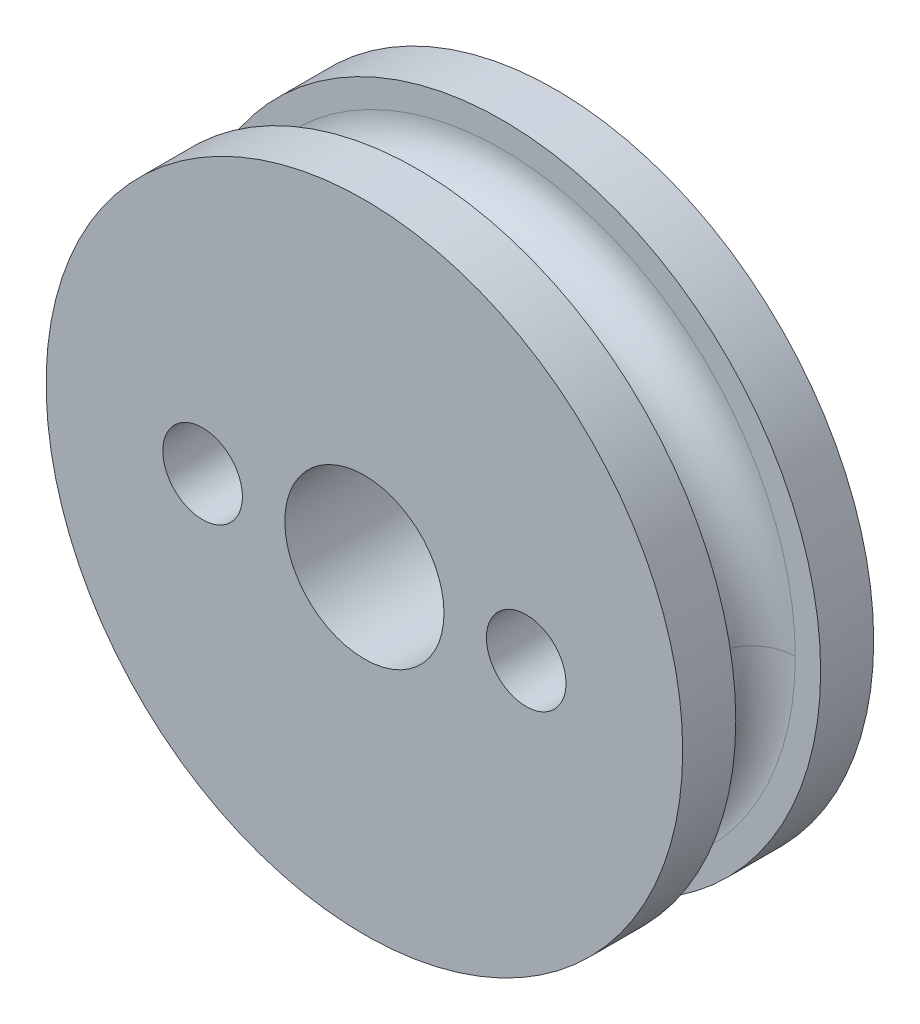
ISO-10303-21;
HEADER;
FILE_DESCRIPTION(('STEP AP214'),'2;1');
FILE_NAME('part.step','',(''),(''),'','','');
FILE_SCHEMA(('AUTOMOTIVE_DESIGN { 1 0 10303 214 1 1 1 1 }'));
ENDSEC;
DATA;
#1=APPLICATION_CONTEXT('core data for automotive mechanical design processes');
#2=APPLICATION_PROTOCOL_DEFINITION('international standard','automotive_design',2000,#1);
#3=PRODUCT_CONTEXT('',#1,'mechanical');
#4=PRODUCT('Part','Part','',(#3));
#5=PRODUCT_RELATED_PRODUCT_CATEGORY('part','',(#4));
#6=PRODUCT_DEFINITION_FORMATION('','',#4);
#7=PRODUCT_DEFINITION_CONTEXT('part definition',#1,'design');
#8=PRODUCT_DEFINITION('design','',#6,#7);
#9=PRODUCT_DEFINITION_SHAPE('','',#8);
#10=(LENGTH_UNIT() NAMED_UNIT(*) SI_UNIT(.MILLI.,.METRE.));
#11=(NAMED_UNIT(*) PLANE_ANGLE_UNIT() SI_UNIT($,.RADIAN.));
#12=(NAMED_UNIT(*) SI_UNIT($,.STERADIAN.) SOLID_ANGLE_UNIT());
#13=UNCERTAINTY_MEASURE_WITH_UNIT(LENGTH_MEASURE(1.E-05),#10,'distance_accuracy_value','');
#14=(GEOMETRIC_REPRESENTATION_CONTEXT(3) GLOBAL_UNCERTAINTY_ASSIGNED_CONTEXT((#13)) GLOBAL_UNIT_ASSIGNED_CONTEXT((#10,
#11,#12)) REPRESENTATION_CONTEXT('',''));
#15=CARTESIAN_POINT('',(0.,0.,0.));
#16=DIRECTION('',(0.,0.,1.));
#17=DIRECTION('',(1.,0.,0.));
#18=AXIS2_PLACEMENT_3D('',#15,#16,#17);
#19=CARTESIAN_POINT('',(-6.1,0.,7.2));
#20=DIRECTION('',(0.,0.,-1.));
#21=DIRECTION('',(-1.,0.,0.));
#22=AXIS2_PLACEMENT_3D('',#19,#20,#21);
#23=CYLINDRICAL_SURFACE('',#22,1.5);
#24=CARTESIAN_POINT('',(-6.1,0.,7.2));
#25=DIRECTION('',(0.,0.,-1.));
#26=DIRECTION('',(-1.,0.,0.));
#27=AXIS2_PLACEMENT_3D('',#24,#25,#26);
#28=CIRCLE('',#27,1.5);
#29=CARTESIAN_POINT('',(-7.6,0.,7.2));
#30=VERTEX_POINT('',#29);
#31=EDGE_CURVE('E110',#30,#30,#28,.T.);
#32=ORIENTED_EDGE('',*,*,#31,.F.);
#33=EDGE_LOOP('',(#32));
#34=FACE_BOUND('',#33,.T.);
#35=CARTESIAN_POINT('',(-6.1,0.,4.));
#36=DIRECTION('',(0.,0.,-1.));
#37=DIRECTION('',(-1.,0.,0.));
#38=AXIS2_PLACEMENT_3D('',#35,#36,#37);
#39=CIRCLE('',#38,1.5);
#40=CARTESIAN_POINT('',(-7.6,0.,4.));
#41=VERTEX_POINT('',#40);
#42=EDGE_CURVE('E37',#41,#41,#39,.F.);
#43=ORIENTED_EDGE('',*,*,#42,.F.);
#44=EDGE_LOOP('',(#43));
#45=FACE_BOUND('',#44,.T.);
#46=ADVANCED_FACE('F33',(#34,#45),#23,.F.);
#47=CARTESIAN_POINT('',(6.1,0.,7.2));
#48=DIRECTION('',(0.,0.,-1.));
#49=DIRECTION('',(-1.,0.,0.));
#50=AXIS2_PLACEMENT_3D('',#47,#48,#49);
#51=CYLINDRICAL_SURFACE('',#50,1.5);
#52=CARTESIAN_POINT('',(6.1,0.,7.2));
#53=DIRECTION('',(0.,0.,-1.));
#54=DIRECTION('',(-1.,0.,0.));
#55=AXIS2_PLACEMENT_3D('',#52,#53,#54);
#56=CIRCLE('',#55,1.5);
#57=CARTESIAN_POINT('',(4.6,0.,7.2));
#58=VERTEX_POINT('',#57);
#59=EDGE_CURVE('E111',#58,#58,#56,.T.);
#60=ORIENTED_EDGE('',*,*,#59,.F.);
#61=EDGE_LOOP('',(#60));
#62=FACE_BOUND('',#61,.T.);
#63=CARTESIAN_POINT('',(6.1,0.,4.));
#64=DIRECTION('',(0.,0.,-1.));
#65=DIRECTION('',(-1.,0.,0.));
#66=AXIS2_PLACEMENT_3D('',#63,#64,#65);
#67=CIRCLE('',#66,1.5);
#68=CARTESIAN_POINT('',(4.6,0.,4.));
#69=VERTEX_POINT('',#68);
#70=EDGE_CURVE('E87',#69,#69,#67,.F.);
#71=ORIENTED_EDGE('',*,*,#70,.F.);
#72=EDGE_LOOP('',(#71));
#73=FACE_BOUND('',#72,.T.);
#74=ADVANCED_FACE('F130',(#62,#73),#51,.F.);
#75=CARTESIAN_POINT('',(0.,0.,2.));
#76=DIRECTION('',(0.,0.,-1.));
#77=DIRECTION('',(-1.,0.,0.));
#78=AXIS2_PLACEMENT_3D('',#75,#76,#77);
#79=CYLINDRICAL_SURFACE('',#78,12.);
#80=CARTESIAN_POINT('',(0.,0.,2.));
#81=DIRECTION('',(0.,0.,1.));
#82=DIRECTION('',(1.,0.,0.));
#83=AXIS2_PLACEMENT_3D('',#80,#81,#82);
#84=CIRCLE('',#83,12.);
#85=CARTESIAN_POINT('',(12.,0.,2.));
#86=VERTEX_POINT('',#85);
#87=EDGE_CURVE('E11',#86,#86,#84,.T.);
#88=ORIENTED_EDGE('',*,*,#87,.F.);
#89=EDGE_LOOP('',(#88));
#90=FACE_BOUND('',#89,.T.);
#91=CARTESIAN_POINT('',(0.,0.,0.));
#92=DIRECTION('',(0.,0.,1.));
#93=DIRECTION('',(1.,0.,0.));
#94=AXIS2_PLACEMENT_3D('',#91,#92,#93);
#95=CIRCLE('',#94,12.);
#96=CARTESIAN_POINT('',(12.,0.,0.));
#97=VERTEX_POINT('',#96);
#98=EDGE_CURVE('E42',#97,#97,#95,.T.);
#99=ORIENTED_EDGE('',*,*,#98,.T.);
#100=EDGE_LOOP('',(#99));
#101=FACE_BOUND('',#100,.T.);
#102=ADVANCED_FACE('F35',(#90,#101),#79,.T.);
#103=CARTESIAN_POINT('',(0.,0.,2.));
#104=DIRECTION('',(0.,0.,1.));
#105=DIRECTION('',(1.,0.,0.));
#106=AXIS2_PLACEMENT_3D('',#103,#104,#105);
#107=PLANE('',#106);
#108=CARTESIAN_POINT('',(0.,0.,2.));
#109=DIRECTION('',(0.,0.,1.));
#110=DIRECTION('',(1.,0.,0.));
#111=AXIS2_PLACEMENT_3D('',#108,#109,#110);
#112=CIRCLE('',#111,11.0428737605284);
#113=CARTESIAN_POINT('',(-11.0428737605284,0.,2.));
#114=VERTEX_POINT('',#113);
#115=CARTESIAN_POINT('',(11.0428737605284,0.,2.));
#116=VERTEX_POINT('',#115);
#117=EDGE_CURVE('E70',#114,#116,#112,.T.);
#118=ORIENTED_EDGE('',*,*,#117,.F.);
#119=CARTESIAN_POINT('',(0.,0.,2.));
#120=DIRECTION('',(0.,0.,1.));
#121=DIRECTION('',(1.,0.,0.));
#122=AXIS2_PLACEMENT_3D('',#119,#120,#121);
#123=CIRCLE('',#122,11.0428737605284);
#124=EDGE_CURVE('E72',#116,#114,#123,.T.);
#125=ORIENTED_EDGE('',*,*,#124,.F.);
#126=EDGE_LOOP('',(#118,#125));
#127=FACE_BOUND('',#126,.T.);
#128=ORIENTED_EDGE('',*,*,#87,.T.);
#129=EDGE_LOOP('',(#128));
#130=FACE_BOUND('',#129,.T.);
#131=ADVANCED_FACE('F125',(#127,#130),#107,.T.);
#132=CARTESIAN_POINT('',(0.,0.,0.));
#133=DIRECTION('',(0.,0.,1.));
#134=DIRECTION('',(1.,0.,0.));
#135=AXIS2_PLACEMENT_3D('',#132,#133,#134);
#136=PLANE('',#135);
#137=CARTESIAN_POINT('',(6.1,0.,0.));
#138=DIRECTION('',(0.,0.,-1.));
#139=DIRECTION('',(-1.,0.,0.));
#140=AXIS2_PLACEMENT_3D('',#137,#138,#139);
#141=CIRCLE('',#140,3.);
#142=CARTESIAN_POINT('',(3.1,0.,0.));
#143=VERTEX_POINT('',#142);
#144=EDGE_CURVE('E94',#143,#143,#141,.T.);
#145=ORIENTED_EDGE('',*,*,#144,.F.);
#146=EDGE_LOOP('',(#145));
#147=FACE_BOUND('',#146,.T.);
#148=CARTESIAN_POINT('',(-6.1,0.,0.));
#149=DIRECTION('',(0.,0.,-1.));
#150=DIRECTION('',(-1.,0.,0.));
#151=AXIS2_PLACEMENT_3D('',#148,#149,#150);
#152=CIRCLE('',#151,3.);
#153=CARTESIAN_POINT('',(-9.1,0.,0.));
#154=VERTEX_POINT('',#153);
#155=EDGE_CURVE('E104',#154,#154,#152,.T.);
#156=ORIENTED_EDGE('',*,*,#155,.F.);
#157=EDGE_LOOP('',(#156));
#158=FACE_BOUND('',#157,.T.);
#159=CARTESIAN_POINT('',(0.,0.,0.));
#160=DIRECTION('',(0.,0.,-1.));
#161=DIRECTION('',(-1.,0.,0.));
#162=AXIS2_PLACEMENT_3D('',#159,#160,#161);
#163=CIRCLE('',#162,3.);
#164=CARTESIAN_POINT('',(-3.,0.,0.));
#165=VERTEX_POINT('',#164);
#166=EDGE_CURVE('E86',#165,#165,#163,.T.);
#167=ORIENTED_EDGE('',*,*,#166,.F.);
#168=EDGE_LOOP('',(#167));
#169=FACE_BOUND('',#168,.T.);
#170=ORIENTED_EDGE('',*,*,#98,.F.);
#171=EDGE_LOOP('',(#170));
#172=FACE_BOUND('',#171,.T.);
#173=ADVANCED_FACE('F121',(#147,#158,#169,#172),#136,.F.);
#174=CARTESIAN_POINT('',(0.,0.,7.2));
#175=DIRECTION('',(0.,0.,-1.));
#176=DIRECTION('',(-1.,0.,0.));
#177=AXIS2_PLACEMENT_3D('',#174,#175,#176);
#178=CYLINDRICAL_SURFACE('',#177,12.);
#179=CARTESIAN_POINT('',(0.,0.,7.2));
#180=DIRECTION('',(0.,0.,1.));
#181=DIRECTION('',(1.,0.,0.));
#182=AXIS2_PLACEMENT_3D('',#179,#180,#181);
#183=CIRCLE('',#182,12.);
#184=CARTESIAN_POINT('',(12.,0.,7.2));
#185=VERTEX_POINT('',#184);
#186=EDGE_CURVE('E76',#185,#185,#183,.T.);
#187=ORIENTED_EDGE('',*,*,#186,.F.);
#188=EDGE_LOOP('',(#187));
#189=FACE_BOUND('',#188,.T.);
#190=CARTESIAN_POINT('',(0.,0.,5.2));
#191=DIRECTION('',(0.,0.,1.));
#192=DIRECTION('',(1.,0.,0.));
#193=AXIS2_PLACEMENT_3D('',#190,#191,#192);
#194=CIRCLE('',#193,12.);
#195=CARTESIAN_POINT('',(12.,0.,5.2));
#196=VERTEX_POINT('',#195);
#197=EDGE_CURVE('E78',#196,#196,#194,.T.);
#198=ORIENTED_EDGE('',*,*,#197,.T.);
#199=EDGE_LOOP('',(#198));
#200=FACE_BOUND('',#199,.T.);
#201=ADVANCED_FACE('F124',(#189,#200),#178,.T.);
#202=CARTESIAN_POINT('',(0.,0.,7.2));
#203=DIRECTION('',(0.,0.,1.));
#204=DIRECTION('',(1.,0.,0.));
#205=AXIS2_PLACEMENT_3D('',#202,#203,#204);
#206=PLANE('',#205);
#207=ORIENTED_EDGE('',*,*,#59,.T.);
#208=EDGE_LOOP('',(#207));
#209=FACE_BOUND('',#208,.T.);
#210=ORIENTED_EDGE('',*,*,#31,.T.);
#211=EDGE_LOOP('',(#210));
#212=FACE_BOUND('',#211,.T.);
#213=CARTESIAN_POINT('',(0.,0.,7.2));
#214=DIRECTION('',(0.,0.,1.));
#215=DIRECTION('',(1.,0.,0.));
#216=AXIS2_PLACEMENT_3D('',#213,#214,#215);
#217=CIRCLE('',#216,3.);
#218=CARTESIAN_POINT('',(3.,0.,7.2));
#219=VERTEX_POINT('',#218);
#220=EDGE_CURVE('E84',#219,#219,#217,.T.);
#221=ORIENTED_EDGE('',*,*,#220,.F.);
#222=EDGE_LOOP('',(#221));
#223=FACE_BOUND('',#222,.T.);
#224=ORIENTED_EDGE('',*,*,#186,.T.);
#225=EDGE_LOOP('',(#224));
#226=FACE_BOUND('',#225,.T.);
#227=ADVANCED_FACE('F154',(#209,#212,#223,#226),#206,.T.);
#228=CARTESIAN_POINT('',(0.,0.,5.2));
#229=DIRECTION('',(0.,0.,1.));
#230=DIRECTION('',(1.,0.,0.));
#231=AXIS2_PLACEMENT_3D('',#228,#229,#230);
#232=PLANE('',#231);
#233=CARTESIAN_POINT('',(0.,0.,5.2));
#234=DIRECTION('',(0.,0.,1.));
#235=DIRECTION('',(1.,0.,0.));
#236=AXIS2_PLACEMENT_3D('',#233,#234,#235);
#237=CIRCLE('',#236,11.);
#238=CARTESIAN_POINT('',(11.,0.,5.2));
#239=VERTEX_POINT('',#238);
#240=CARTESIAN_POINT('',(-11.,0.,5.2));
#241=VERTEX_POINT('',#240);
#242=EDGE_CURVE('E61',#239,#241,#237,.T.);
#243=ORIENTED_EDGE('',*,*,#242,.T.);
#244=EDGE_CURVE('E65',#241,#239,#237,.T.);
#245=ORIENTED_EDGE('',*,*,#244,.T.);
#246=EDGE_LOOP('',(#243,#245));
#247=FACE_BOUND('',#246,.T.);
#248=ORIENTED_EDGE('',*,*,#197,.F.);
#249=EDGE_LOOP('',(#248));
#250=FACE_BOUND('',#249,.T.);
#251=ADVANCED_FACE('F74',(#247,#250),#232,.F.);
#252=CARTESIAN_POINT('',(0.,0.,30.));
#253=DIRECTION('',(0.,0.,-1.));
#254=DIRECTION('',(-1.,0.,0.));
#255=AXIS2_PLACEMENT_3D('',#252,#253,#254);
#256=CYLINDRICAL_SURFACE('',#255,3.);
#257=ORIENTED_EDGE('',*,*,#220,.T.);
#258=EDGE_LOOP('',(#257));
#259=FACE_BOUND('',#258,.T.);
#260=ORIENTED_EDGE('',*,*,#166,.T.);
#261=EDGE_LOOP('',(#260));
#262=FACE_BOUND('',#261,.T.);
#263=ADVANCED_FACE('F119',(#259,#262),#256,.F.);
#264=CARTESIAN_POINT('',(0.,0.,3.59971278760284));
#265=DIRECTION('',(0.,0.,-1.));
#266=DIRECTION('',(-1.,0.,0.));
#267=AXIS2_PLACEMENT_3D('',#264,#265,#266);
#268=TOROIDAL_SURFACE('',#267,11.,1.60028721239716);
#269=ORIENTED_EDGE('',*,*,#117,.T.);
#270=CARTESIAN_POINT('',(11.,0.,3.59971278760284));
#271=DIRECTION('',(0.,-1.,0.));
#272=DIRECTION('',(0.,0.,1.));
#273=AXIS2_PLACEMENT_3D('',#270,#271,#272);
#274=CIRCLE('',#273,1.60028721239716);
#275=EDGE_CURVE('E50',#239,#116,#274,.T.);
#276=ORIENTED_EDGE('',*,*,#275,.F.);
#277=ORIENTED_EDGE('',*,*,#244,.F.);
#278=CARTESIAN_POINT('',(-11.,0.,3.59971278760284));
#279=DIRECTION('',(0.,1.,0.));
#280=DIRECTION('',(0.,0.,1.));
#281=AXIS2_PLACEMENT_3D('',#278,#279,#280);
#282=CIRCLE('',#281,1.60028721239716);
#283=EDGE_CURVE('E55',#241,#114,#282,.T.);
#284=ORIENTED_EDGE('',*,*,#283,.T.);
#285=EDGE_LOOP('',(#269,#276,#277,#284));
#286=FACE_BOUND('',#285,.T.);
#287=ADVANCED_FACE('F68',(#286),#268,.F.);
#288=CARTESIAN_POINT('',(0.,0.,3.59971278760284));
#289=DIRECTION('',(0.,0.,-1.));
#290=DIRECTION('',(-1.,0.,0.));
#291=AXIS2_PLACEMENT_3D('',#288,#289,#290);
#292=TOROIDAL_SURFACE('',#291,11.,1.60028721239716);
#293=ORIENTED_EDGE('',*,*,#124,.T.);
#294=ORIENTED_EDGE('',*,*,#283,.F.);
#295=ORIENTED_EDGE('',*,*,#242,.F.);
#296=ORIENTED_EDGE('',*,*,#275,.T.);
#297=EDGE_LOOP('',(#293,#294,#295,#296));
#298=FACE_BOUND('',#297,.T.);
#299=ADVANCED_FACE('F62',(#298),#292,.F.);
#300=CARTESIAN_POINT('',(6.1,0.,4.));
#301=DIRECTION('',(0.,0.,-1.));
#302=DIRECTION('',(-1.,0.,0.));
#303=AXIS2_PLACEMENT_3D('',#300,#301,#302);
#304=PLANE('',#303);
#305=CARTESIAN_POINT('',(6.1,0.,4.));
#306=DIRECTION('',(0.,0.,-1.));
#307=DIRECTION('',(-1.,0.,0.));
#308=AXIS2_PLACEMENT_3D('',#305,#306,#307);
#309=CIRCLE('',#308,3.);
#310=CARTESIAN_POINT('',(3.1,0.,4.));
#311=VERTEX_POINT('',#310);
#312=EDGE_CURVE('E89',#311,#311,#309,.T.);
#313=ORIENTED_EDGE('',*,*,#312,.T.);
#314=EDGE_LOOP('',(#313));
#315=FACE_BOUND('',#314,.T.);
#316=ORIENTED_EDGE('',*,*,#70,.T.);
#317=EDGE_LOOP('',(#316));
#318=FACE_BOUND('',#317,.T.);
#319=ADVANCED_FACE('F195',(#315,#318),#304,.T.);
#320=CARTESIAN_POINT('',(6.1,0.,4.));
#321=DIRECTION('',(0.,0.,-1.));
#322=DIRECTION('',(-1.,0.,0.));
#323=AXIS2_PLACEMENT_3D('',#320,#321,#322);
#324=CYLINDRICAL_SURFACE('',#323,3.);
#325=ORIENTED_EDGE('',*,*,#312,.F.);
#326=EDGE_LOOP('',(#325));
#327=FACE_BOUND('',#326,.T.);
#328=ORIENTED_EDGE('',*,*,#144,.T.);
#329=EDGE_LOOP('',(#328));
#330=FACE_BOUND('',#329,.T.);
#331=ADVANCED_FACE('F212',(#327,#330),#324,.F.);
#332=CARTESIAN_POINT('',(-6.1,0.,4.));
#333=DIRECTION('',(0.,0.,-1.));
#334=DIRECTION('',(-1.,0.,0.));
#335=AXIS2_PLACEMENT_3D('',#332,#333,#334);
#336=PLANE('',#335);
#337=CARTESIAN_POINT('',(-6.1,0.,4.));
#338=DIRECTION('',(0.,0.,-1.));
#339=DIRECTION('',(-1.,0.,0.));
#340=AXIS2_PLACEMENT_3D('',#337,#338,#339);
#341=CIRCLE('',#340,3.);
#342=CARTESIAN_POINT('',(-9.1,0.,4.));
#343=VERTEX_POINT('',#342);
#344=EDGE_CURVE('E99',#343,#343,#341,.T.);
#345=ORIENTED_EDGE('',*,*,#344,.T.);
#346=EDGE_LOOP('',(#345));
#347=FACE_BOUND('',#346,.T.);
#348=ORIENTED_EDGE('',*,*,#42,.T.);
#349=EDGE_LOOP('',(#348));
#350=FACE_BOUND('',#349,.T.);
#351=ADVANCED_FACE('F218',(#347,#350),#336,.T.);
#352=CARTESIAN_POINT('',(-6.1,0.,4.));
#353=DIRECTION('',(0.,0.,-1.));
#354=DIRECTION('',(-1.,0.,0.));
#355=AXIS2_PLACEMENT_3D('',#352,#353,#354);
#356=CYLINDRICAL_SURFACE('',#355,3.);
#357=ORIENTED_EDGE('',*,*,#344,.F.);
#358=EDGE_LOOP('',(#357));
#359=FACE_BOUND('',#358,.T.);
#360=ORIENTED_EDGE('',*,*,#155,.T.);
#361=EDGE_LOOP('',(#360));
#362=FACE_BOUND('',#361,.T.);
#363=ADVANCED_FACE('F226',(#359,#362),#356,.F.);
#364=CLOSED_SHELL('',(#46,#74,#102,#131,#173,#201,#227,#251,#263,#287,#299,#319,#331,#351,#363));
#365=MANIFOLD_SOLID_BREP('B2',#364);
#366=ADVANCED_BREP_SHAPE_REPRESENTATION('',(#18,#365),#14);
#367=SHAPE_DEFINITION_REPRESENTATION(#9,#366);
ENDSEC;
END-ISO-10303-21;
